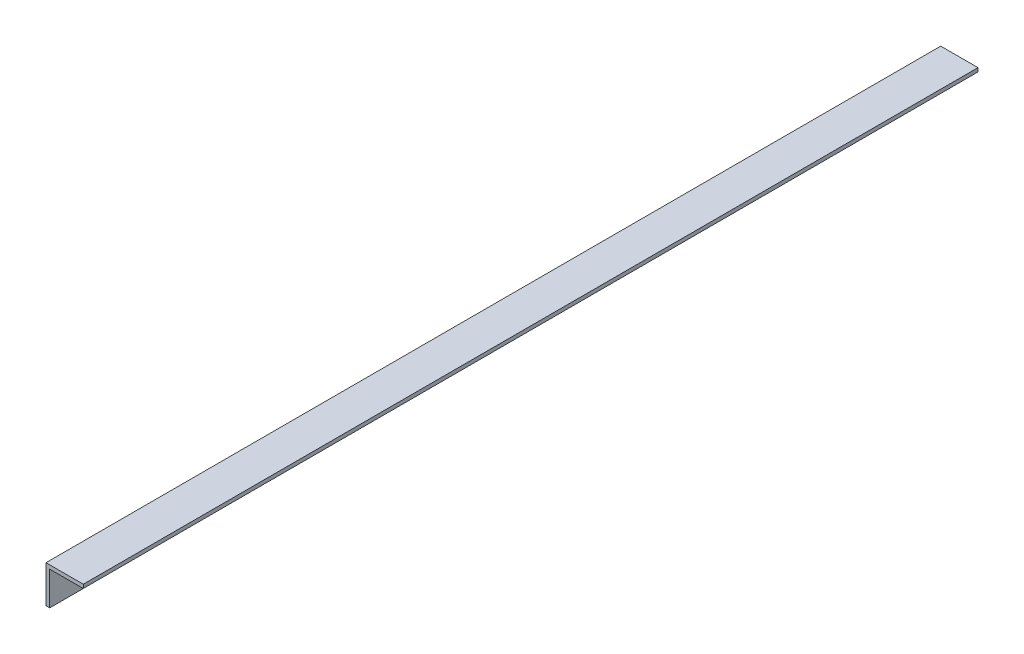
ISO-10303-21;
HEADER;
FILE_DESCRIPTION(('STEP AP214'),'2;1');
FILE_NAME('part.step','',(''),(''),'','','');
FILE_SCHEMA(('AUTOMOTIVE_DESIGN { 1 0 10303 214 1 1 1 1 }'));
ENDSEC;
DATA;
#1=APPLICATION_CONTEXT('core data for automotive mechanical design processes');
#2=APPLICATION_PROTOCOL_DEFINITION('international standard','automotive_design',2000,#1);
#3=PRODUCT_CONTEXT('',#1,'mechanical');
#4=PRODUCT('Part','Part','',(#3));
#5=PRODUCT_RELATED_PRODUCT_CATEGORY('part','',(#4));
#6=PRODUCT_DEFINITION_FORMATION('','',#4);
#7=PRODUCT_DEFINITION_CONTEXT('part definition',#1,'design');
#8=PRODUCT_DEFINITION('design','',#6,#7);
#9=PRODUCT_DEFINITION_SHAPE('','',#8);
#10=(LENGTH_UNIT() NAMED_UNIT(*) SI_UNIT(.MILLI.,.METRE.));
#11=(NAMED_UNIT(*) PLANE_ANGLE_UNIT() SI_UNIT($,.RADIAN.));
#12=(NAMED_UNIT(*) SI_UNIT($,.STERADIAN.) SOLID_ANGLE_UNIT());
#13=UNCERTAINTY_MEASURE_WITH_UNIT(LENGTH_MEASURE(1.E-05),#10,'distance_accuracy_value','');
#14=(GEOMETRIC_REPRESENTATION_CONTEXT(3) GLOBAL_UNCERTAINTY_ASSIGNED_CONTEXT((#13)) GLOBAL_UNIT_ASSIGNED_CONTEXT((#10,
#11,#12)) REPRESENTATION_CONTEXT('',''));
#15=CARTESIAN_POINT('',(0.,0.,0.));
#16=DIRECTION('',(0.,0.,1.));
#17=DIRECTION('',(1.,0.,0.));
#18=AXIS2_PLACEMENT_3D('',#15,#16,#17);
#19=CARTESIAN_POINT('',(0.,-5.,-1200.));
#20=DIRECTION('',(0.,-1.,0.));
#21=DIRECTION('',(0.,0.,-1.));
#22=AXIS2_PLACEMENT_3D('',#19,#20,#21);
#23=PLANE('',#22);
#24=DIRECTION('',(1.,0.,0.));
#25=VECTOR('',#24,1.);
#26=CARTESIAN_POINT('',(0.,-5.,0.));
#27=LINE('',#26,#25);
#28=CARTESIAN_POINT('',(5.,-5.,0.));
#29=VERTEX_POINT('',#28);
#30=CARTESIAN_POINT('',(50.,-5.,0.));
#31=VERTEX_POINT('',#30);
#32=EDGE_CURVE('E115',#29,#31,#27,.T.);
#33=ORIENTED_EDGE('',*,*,#32,.F.);
#34=DIRECTION('',(0.,0.,1.));
#35=VECTOR('',#34,1.);
#36=CARTESIAN_POINT('',(5.,-5.,-1200.));
#37=LINE('',#36,#35);
#38=CARTESIAN_POINT('',(5.,-5.,-1200.));
#39=VERTEX_POINT('',#38);
#40=EDGE_CURVE('E11',#39,#29,#37,.T.);
#41=ORIENTED_EDGE('',*,*,#40,.F.);
#42=DIRECTION('',(1.,0.,0.));
#43=VECTOR('',#42,1.);
#44=CARTESIAN_POINT('',(0.,-5.,-1200.));
#45=LINE('',#44,#43);
#46=CARTESIAN_POINT('',(50.,-5.,-1200.));
#47=VERTEX_POINT('',#46);
#48=EDGE_CURVE('E128',#39,#47,#45,.T.);
#49=ORIENTED_EDGE('',*,*,#48,.T.);
#50=DIRECTION('',(0.,0.,1.));
#51=VECTOR('',#50,1.);
#52=CARTESIAN_POINT('',(50.,-5.,-1200.));
#53=LINE('',#52,#51);
#54=EDGE_CURVE('E36',#47,#31,#53,.T.);
#55=ORIENTED_EDGE('',*,*,#54,.T.);
#56=EDGE_LOOP('',(#33,#41,#49,#55));
#57=FACE_BOUND('',#56,.T.);
#58=ADVANCED_FACE('F33',(#57),#23,.T.);
#59=CARTESIAN_POINT('',(5.,0.,-1200.));
#60=DIRECTION('',(1.,0.,0.));
#61=DIRECTION('',(0.,1.,0.));
#62=AXIS2_PLACEMENT_3D('',#59,#60,#61);
#63=PLANE('',#62);
#64=DIRECTION('',(0.,1.,0.));
#65=VECTOR('',#64,1.);
#66=CARTESIAN_POINT('',(5.,0.,0.));
#67=LINE('',#66,#65);
#68=CARTESIAN_POINT('',(5.00000000000001,-50.,0.));
#69=VERTEX_POINT('',#68);
#70=EDGE_CURVE('E126',#69,#29,#67,.T.);
#71=ORIENTED_EDGE('',*,*,#70,.F.);
#72=DIRECTION('',(0.,0.,1.));
#73=VECTOR('',#72,1.);
#74=CARTESIAN_POINT('',(5.00000000000001,-50.,-1200.));
#75=LINE('',#74,#73);
#76=CARTESIAN_POINT('',(5.00000000000001,-50.,-1200.));
#77=VERTEX_POINT('',#76);
#78=EDGE_CURVE('E42',#77,#69,#75,.T.);
#79=ORIENTED_EDGE('',*,*,#78,.F.);
#80=DIRECTION('',(0.,1.,0.));
#81=VECTOR('',#80,1.);
#82=CARTESIAN_POINT('',(5.,0.,-1200.));
#83=LINE('',#82,#81);
#84=EDGE_CURVE('E96',#77,#39,#83,.T.);
#85=ORIENTED_EDGE('',*,*,#84,.T.);
#86=ORIENTED_EDGE('',*,*,#40,.T.);
#87=EDGE_LOOP('',(#71,#79,#85,#86));
#88=FACE_BOUND('',#87,.T.);
#89=ADVANCED_FACE('F140',(#88),#63,.T.);
#90=CARTESIAN_POINT('',(5.00000000000001,-50.,-1200.));
#91=DIRECTION('',(0.,1.,0.));
#92=DIRECTION('',(0.,0.,1.));
#93=AXIS2_PLACEMENT_3D('',#90,#91,#92);
#94=PLANE('',#93);
#95=DIRECTION('',(-1.,0.,0.));
#96=VECTOR('',#95,1.);
#97=CARTESIAN_POINT('',(5.00000000000001,-50.,0.));
#98=LINE('',#97,#96);
#99=CARTESIAN_POINT('',(0.,-50.,0.));
#100=VERTEX_POINT('',#99);
#101=EDGE_CURVE('E101',#69,#100,#98,.T.);
#102=ORIENTED_EDGE('',*,*,#101,.T.);
#103=DIRECTION('',(0.,0.,1.));
#104=VECTOR('',#103,1.);
#105=CARTESIAN_POINT('',(0.,-50.,-1200.));
#106=LINE('',#105,#104);
#107=CARTESIAN_POINT('',(0.,-50.,-1200.));
#108=VERTEX_POINT('',#107);
#109=EDGE_CURVE('E99',#108,#100,#106,.T.);
#110=ORIENTED_EDGE('',*,*,#109,.F.);
#111=DIRECTION('',(-1.,0.,0.));
#112=VECTOR('',#111,1.);
#113=CARTESIAN_POINT('',(5.00000000000001,-50.,-1200.));
#114=LINE('',#113,#112);
#115=EDGE_CURVE('E90',#77,#108,#114,.T.);
#116=ORIENTED_EDGE('',*,*,#115,.F.);
#117=ORIENTED_EDGE('',*,*,#78,.T.);
#118=EDGE_LOOP('',(#102,#110,#116,#117));
#119=FACE_BOUND('',#118,.T.);
#120=ADVANCED_FACE('F100',(#119),#94,.F.);
#121=CARTESIAN_POINT('',(0.,0.,-1200.));
#122=DIRECTION('',(1.,0.,0.));
#123=DIRECTION('',(0.,1.,0.));
#124=AXIS2_PLACEMENT_3D('',#121,#122,#123);
#125=PLANE('',#124);
#126=DIRECTION('',(0.,1.,0.));
#127=VECTOR('',#126,1.);
#128=CARTESIAN_POINT('',(0.,0.,0.));
#129=LINE('',#128,#127);
#130=CARTESIAN_POINT('',(0.,0.,0.));
#131=VERTEX_POINT('',#130);
#132=EDGE_CURVE('E123',#100,#131,#129,.T.);
#133=ORIENTED_EDGE('',*,*,#132,.T.);
#134=DIRECTION('',(0.,0.,1.));
#135=VECTOR('',#134,1.);
#136=CARTESIAN_POINT('',(0.,0.,-1200.));
#137=LINE('',#136,#135);
#138=CARTESIAN_POINT('',(0.,0.,-1200.));
#139=VERTEX_POINT('',#138);
#140=EDGE_CURVE('E104',#139,#131,#137,.T.);
#141=ORIENTED_EDGE('',*,*,#140,.F.);
#142=DIRECTION('',(0.,1.,0.));
#143=VECTOR('',#142,1.);
#144=CARTESIAN_POINT('',(0.,0.,-1200.));
#145=LINE('',#144,#143);
#146=EDGE_CURVE('E94',#108,#139,#145,.T.);
#147=ORIENTED_EDGE('',*,*,#146,.F.);
#148=ORIENTED_EDGE('',*,*,#109,.T.);
#149=EDGE_LOOP('',(#133,#141,#147,#148));
#150=FACE_BOUND('',#149,.T.);
#151=ADVANCED_FACE('F106',(#150),#125,.F.);
#152=CARTESIAN_POINT('',(0.,0.,-1200.));
#153=DIRECTION('',(0.,-1.,0.));
#154=DIRECTION('',(0.,0.,-1.));
#155=AXIS2_PLACEMENT_3D('',#152,#153,#154);
#156=PLANE('',#155);
#157=DIRECTION('',(1.,0.,0.));
#158=VECTOR('',#157,1.);
#159=CARTESIAN_POINT('',(0.,0.,0.));
#160=LINE('',#159,#158);
#161=CARTESIAN_POINT('',(50.,0.,0.));
#162=VERTEX_POINT('',#161);
#163=EDGE_CURVE('E121',#131,#162,#160,.T.);
#164=ORIENTED_EDGE('',*,*,#163,.T.);
#165=DIRECTION('',(0.,0.,1.));
#166=VECTOR('',#165,1.);
#167=CARTESIAN_POINT('',(50.,0.,-1200.));
#168=LINE('',#167,#166);
#169=CARTESIAN_POINT('',(50.,0.,-1200.));
#170=VERTEX_POINT('',#169);
#171=EDGE_CURVE('E131',#170,#162,#168,.T.);
#172=ORIENTED_EDGE('',*,*,#171,.F.);
#173=DIRECTION('',(1.,0.,0.));
#174=VECTOR('',#173,1.);
#175=CARTESIAN_POINT('',(0.,0.,-1200.));
#176=LINE('',#175,#174);
#177=EDGE_CURVE('E109',#139,#170,#176,.T.);
#178=ORIENTED_EDGE('',*,*,#177,.F.);
#179=ORIENTED_EDGE('',*,*,#140,.T.);
#180=EDGE_LOOP('',(#164,#172,#178,#179));
#181=FACE_BOUND('',#180,.T.);
#182=ADVANCED_FACE('F153',(#181),#156,.F.);
#183=CARTESIAN_POINT('',(50.,0.,-1200.));
#184=DIRECTION('',(-1.,0.,0.));
#185=DIRECTION('',(0.,0.,1.));
#186=AXIS2_PLACEMENT_3D('',#183,#184,#185);
#187=PLANE('',#186);
#188=DIRECTION('',(0.,-1.,0.));
#189=VECTOR('',#188,1.);
#190=CARTESIAN_POINT('',(50.,0.,0.));
#191=LINE('',#190,#189);
#192=EDGE_CURVE('E118',#162,#31,#191,.T.);
#193=ORIENTED_EDGE('',*,*,#192,.T.);
#194=ORIENTED_EDGE('',*,*,#54,.F.);
#195=DIRECTION('',(0.,-1.,0.));
#196=VECTOR('',#195,1.);
#197=CARTESIAN_POINT('',(50.,0.,-1200.));
#198=LINE('',#197,#196);
#199=EDGE_CURVE('E82',#170,#47,#198,.T.);
#200=ORIENTED_EDGE('',*,*,#199,.F.);
#201=ORIENTED_EDGE('',*,*,#171,.T.);
#202=EDGE_LOOP('',(#193,#194,#200,#201));
#203=FACE_BOUND('',#202,.T.);
#204=ADVANCED_FACE('F136',(#203),#187,.F.);
#205=CARTESIAN_POINT('',(0.,0.,-1200.));
#206=DIRECTION('',(0.,0.,-1.));
#207=DIRECTION('',(-1.,0.,0.));
#208=AXIS2_PLACEMENT_3D('',#205,#206,#207);
#209=PLANE('',#208);
#210=ORIENTED_EDGE('',*,*,#48,.F.);
#211=ORIENTED_EDGE('',*,*,#84,.F.);
#212=ORIENTED_EDGE('',*,*,#115,.T.);
#213=ORIENTED_EDGE('',*,*,#146,.T.);
#214=ORIENTED_EDGE('',*,*,#177,.T.);
#215=ORIENTED_EDGE('',*,*,#199,.T.);
#216=EDGE_LOOP('',(#210,#211,#212,#213,#214,#215));
#217=FACE_BOUND('',#216,.T.);
#218=ADVANCED_FACE('F92',(#217),#209,.T.);
#219=CARTESIAN_POINT('',(0.,0.,0.));
#220=DIRECTION('',(0.,0.,-1.));
#221=DIRECTION('',(-1.,0.,0.));
#222=AXIS2_PLACEMENT_3D('',#219,#220,#221);
#223=PLANE('',#222);
#224=ORIENTED_EDGE('',*,*,#32,.T.);
#225=ORIENTED_EDGE('',*,*,#192,.F.);
#226=ORIENTED_EDGE('',*,*,#163,.F.);
#227=ORIENTED_EDGE('',*,*,#132,.F.);
#228=ORIENTED_EDGE('',*,*,#101,.F.);
#229=ORIENTED_EDGE('',*,*,#70,.T.);
#230=EDGE_LOOP('',(#224,#225,#226,#227,#228,#229));
#231=FACE_BOUND('',#230,.T.);
#232=ADVANCED_FACE('F139',(#231),#223,.F.);
#233=CLOSED_SHELL('',(#58,#89,#120,#151,#182,#204,#218,#232));
#234=MANIFOLD_SOLID_BREP('B2',#233);
#235=ADVANCED_BREP_SHAPE_REPRESENTATION('',(#18,#234),#14);
#236=SHAPE_DEFINITION_REPRESENTATION(#9,#235);
ENDSEC;
END-ISO-10303-21;
